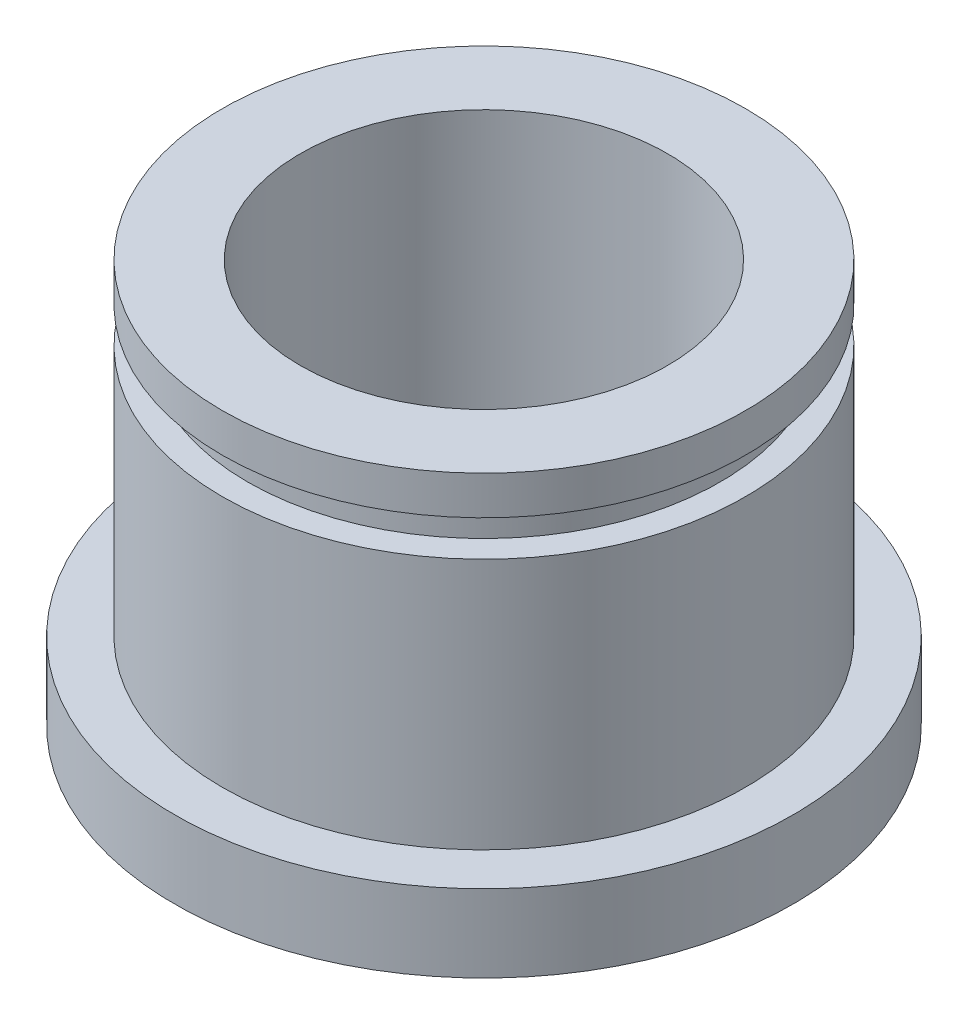
ISO-10303-21;
HEADER;
FILE_DESCRIPTION(('STEP AP214'),'2;1');
FILE_NAME('part.step','',(''),(''),'','','');
FILE_SCHEMA(('AUTOMOTIVE_DESIGN { 1 0 10303 214 1 1 1 1 }'));
ENDSEC;
DATA;
#1=APPLICATION_CONTEXT('core data for automotive mechanical design processes');
#2=APPLICATION_PROTOCOL_DEFINITION('international standard','automotive_design',2000,#1);
#3=PRODUCT_CONTEXT('',#1,'mechanical');
#4=PRODUCT('Part','Part','',(#3));
#5=PRODUCT_RELATED_PRODUCT_CATEGORY('part','',(#4));
#6=PRODUCT_DEFINITION_FORMATION('','',#4);
#7=PRODUCT_DEFINITION_CONTEXT('part definition',#1,'design');
#8=PRODUCT_DEFINITION('design','',#6,#7);
#9=PRODUCT_DEFINITION_SHAPE('','',#8);
#10=(LENGTH_UNIT() NAMED_UNIT(*) SI_UNIT(.MILLI.,.METRE.));
#11=(NAMED_UNIT(*) PLANE_ANGLE_UNIT() SI_UNIT($,.RADIAN.));
#12=(NAMED_UNIT(*) SI_UNIT($,.STERADIAN.) SOLID_ANGLE_UNIT());
#13=UNCERTAINTY_MEASURE_WITH_UNIT(LENGTH_MEASURE(1.E-05),#10,'distance_accuracy_value','');
#14=(GEOMETRIC_REPRESENTATION_CONTEXT(3) GLOBAL_UNCERTAINTY_ASSIGNED_CONTEXT((#13)) GLOBAL_UNIT_ASSIGNED_CONTEXT((#10,
#11,#12)) REPRESENTATION_CONTEXT('',''));
#15=CARTESIAN_POINT('',(0.,0.,0.));
#16=DIRECTION('',(0.,0.,1.));
#17=DIRECTION('',(1.,0.,0.));
#18=AXIS2_PLACEMENT_3D('',#15,#16,#17);
#19=CARTESIAN_POINT('',(0.,-4.143375,0.));
#20=DIRECTION('',(0.,1.,0.));
#21=DIRECTION('',(0.,0.,1.));
#22=AXIS2_PLACEMENT_3D('',#19,#20,#21);
#23=PLANE('',#22);
#24=CARTESIAN_POINT('',(0.,-4.143375,0.));
#25=DIRECTION('',(0.,1.,0.));
#26=DIRECTION('',(0.,0.,1.));
#27=AXIS2_PLACEMENT_3D('',#24,#25,#26);
#28=CIRCLE('',#27,4.56412599999999);
#29=CARTESIAN_POINT('',(0.,-4.143375,4.56412599999999));
#30=VERTEX_POINT('',#29);
#31=EDGE_CURVE('E44',#30,#30,#28,.T.);
#32=ORIENTED_EDGE('',*,*,#31,.T.);
#33=EDGE_LOOP('',(#32));
#34=FACE_BOUND('',#33,.T.);
#35=CARTESIAN_POINT('',(0.,-4.143375,0.));
#36=DIRECTION('',(0.,-1.,0.));
#37=DIRECTION('',(0.,0.,-1.));
#38=AXIS2_PLACEMENT_3D('',#35,#36,#37);
#39=CIRCLE('',#38,6.35);
#40=CARTESIAN_POINT('',(0.,-4.143375,-6.35));
#41=VERTEX_POINT('',#40);
#42=EDGE_CURVE('E50',#41,#41,#39,.T.);
#43=ORIENTED_EDGE('',*,*,#42,.T.);
#44=EDGE_LOOP('',(#43));
#45=FACE_BOUND('',#44,.T.);
#46=ADVANCED_FACE('F36',(#34,#45),#23,.F.);
#47=CARTESIAN_POINT('',(0.,0.,0.));
#48=DIRECTION('',(0.,-1.,0.));
#49=DIRECTION('',(0.,0.,-1.));
#50=AXIS2_PLACEMENT_3D('',#47,#48,#49);
#51=CYLINDRICAL_SURFACE('',#50,6.35);
#52=ORIENTED_EDGE('',*,*,#42,.F.);
#53=EDGE_LOOP('',(#52));
#54=FACE_BOUND('',#53,.T.);
#55=CARTESIAN_POINT('',(0.,-2.555875,0.));
#56=DIRECTION('',(0.,-1.,0.));
#57=DIRECTION('',(0.,0.,-1.));
#58=AXIS2_PLACEMENT_3D('',#55,#56,#57);
#59=CIRCLE('',#58,6.35);
#60=CARTESIAN_POINT('',(0.,-2.555875,-6.35));
#61=VERTEX_POINT('',#60);
#62=EDGE_CURVE('E56',#61,#61,#59,.T.);
#63=ORIENTED_EDGE('',*,*,#62,.T.);
#64=EDGE_LOOP('',(#63));
#65=FACE_BOUND('',#64,.T.);
#66=ADVANCED_FACE('F113',(#54,#65),#51,.T.);
#67=CARTESIAN_POINT('',(0.,-2.555875,6.35));
#68=DIRECTION('',(0.,-1.,0.));
#69=DIRECTION('',(0.,0.,-1.));
#70=AXIS2_PLACEMENT_3D('',#67,#68,#69);
#71=PLANE('',#70);
#72=ORIENTED_EDGE('',*,*,#62,.F.);
#73=EDGE_LOOP('',(#72));
#74=FACE_BOUND('',#73,.T.);
#75=CARTESIAN_POINT('',(0.,-2.555875,0.));
#76=DIRECTION('',(0.,-1.,0.));
#77=DIRECTION('',(0.,0.,-1.));
#78=AXIS2_PLACEMENT_3D('',#75,#76,#77);
#79=CIRCLE('',#78,5.3721);
#80=CARTESIAN_POINT('',(0.,-2.555875,-5.3721));
#81=VERTEX_POINT('',#80);
#82=EDGE_CURVE('E62',#81,#81,#79,.T.);
#83=ORIENTED_EDGE('',*,*,#82,.T.);
#84=EDGE_LOOP('',(#83));
#85=FACE_BOUND('',#84,.T.);
#86=ADVANCED_FACE('F117',(#74,#85),#71,.F.);
#87=CARTESIAN_POINT('',(0.,0.,0.));
#88=DIRECTION('',(0.,-1.,0.));
#89=DIRECTION('',(0.,0.,-1.));
#90=AXIS2_PLACEMENT_3D('',#87,#88,#89);
#91=CYLINDRICAL_SURFACE('',#90,5.3721);
#92=ORIENTED_EDGE('',*,*,#82,.F.);
#93=EDGE_LOOP('',(#92));
#94=FACE_BOUND('',#93,.T.);
#95=CARTESIAN_POINT('',(0.,2.613025,0.));
#96=DIRECTION('',(0.,-1.,0.));
#97=DIRECTION('',(0.,0.,-1.));
#98=AXIS2_PLACEMENT_3D('',#95,#96,#97);
#99=CIRCLE('',#98,5.3721);
#100=CARTESIAN_POINT('',(0.,2.613025,-5.3721));
#101=VERTEX_POINT('',#100);
#102=EDGE_CURVE('E66',#101,#101,#99,.T.);
#103=ORIENTED_EDGE('',*,*,#102,.T.);
#104=EDGE_LOOP('',(#103));
#105=FACE_BOUND('',#104,.T.);
#106=ADVANCED_FACE('F124',(#94,#105),#91,.T.);
#107=CARTESIAN_POINT('',(0.,2.613025,5.3721));
#108=DIRECTION('',(0.,-1.,0.));
#109=DIRECTION('',(0.,0.,-1.));
#110=AXIS2_PLACEMENT_3D('',#107,#108,#109);
#111=PLANE('',#110);
#112=ORIENTED_EDGE('',*,*,#102,.F.);
#113=EDGE_LOOP('',(#112));
#114=FACE_BOUND('',#113,.T.);
#115=CARTESIAN_POINT('',(0.,2.613025,0.));
#116=DIRECTION('',(0.,-1.,0.));
#117=DIRECTION('',(0.,0.,-1.));
#118=AXIS2_PLACEMENT_3D('',#115,#116,#117);
#119=CIRCLE('',#118,4.8514);
#120=CARTESIAN_POINT('',(0.,2.613025,-4.8514));
#121=VERTEX_POINT('',#120);
#122=EDGE_CURVE('E70',#121,#121,#119,.T.);
#123=ORIENTED_EDGE('',*,*,#122,.T.);
#124=EDGE_LOOP('',(#123));
#125=FACE_BOUND('',#124,.T.);
#126=ADVANCED_FACE('F128',(#114,#125),#111,.F.);
#127=CARTESIAN_POINT('',(0.,0.,0.));
#128=DIRECTION('',(0.,-1.,0.));
#129=DIRECTION('',(0.,0.,-1.));
#130=AXIS2_PLACEMENT_3D('',#127,#128,#129);
#131=CYLINDRICAL_SURFACE('',#130,4.8514);
#132=ORIENTED_EDGE('',*,*,#122,.F.);
#133=EDGE_LOOP('',(#132));
#134=FACE_BOUND('',#133,.T.);
#135=CARTESIAN_POINT('',(0.,3.349625,0.));
#136=DIRECTION('',(0.,-1.,0.));
#137=DIRECTION('',(0.,0.,-1.));
#138=AXIS2_PLACEMENT_3D('',#135,#136,#137);
#139=CIRCLE('',#138,4.8514);
#140=CARTESIAN_POINT('',(0.,3.349625,-4.8514));
#141=VERTEX_POINT('',#140);
#142=EDGE_CURVE('E74',#141,#141,#139,.T.);
#143=ORIENTED_EDGE('',*,*,#142,.T.);
#144=EDGE_LOOP('',(#143));
#145=FACE_BOUND('',#144,.T.);
#146=ADVANCED_FACE('F108',(#134,#145),#131,.T.);
#147=CARTESIAN_POINT('',(0.,3.349625,4.8514));
#148=DIRECTION('',(0.,1.,0.));
#149=DIRECTION('',(0.,0.,1.));
#150=AXIS2_PLACEMENT_3D('',#147,#148,#149);
#151=PLANE('',#150);
#152=ORIENTED_EDGE('',*,*,#142,.F.);
#153=EDGE_LOOP('',(#152));
#154=FACE_BOUND('',#153,.T.);
#155=CARTESIAN_POINT('',(0.,3.349625,0.));
#156=DIRECTION('',(0.,-1.,0.));
#157=DIRECTION('',(0.,0.,-1.));
#158=AXIS2_PLACEMENT_3D('',#155,#156,#157);
#159=CIRCLE('',#158,5.3721);
#160=CARTESIAN_POINT('',(0.,3.349625,-5.3721));
#161=VERTEX_POINT('',#160);
#162=EDGE_CURVE('E78',#161,#161,#159,.T.);
#163=ORIENTED_EDGE('',*,*,#162,.T.);
#164=EDGE_LOOP('',(#163));
#165=FACE_BOUND('',#164,.T.);
#166=ADVANCED_FACE('F102',(#154,#165),#151,.F.);
#167=CARTESIAN_POINT('',(0.,0.,0.));
#168=DIRECTION('',(0.,-1.,0.));
#169=DIRECTION('',(0.,0.,-1.));
#170=AXIS2_PLACEMENT_3D('',#167,#168,#169);
#171=CYLINDRICAL_SURFACE('',#170,5.3721);
#172=ORIENTED_EDGE('',*,*,#162,.F.);
#173=EDGE_LOOP('',(#172));
#174=FACE_BOUND('',#173,.T.);
#175=CARTESIAN_POINT('',(0.,4.143375,0.));
#176=DIRECTION('',(0.,-1.,0.));
#177=DIRECTION('',(0.,0.,-1.));
#178=AXIS2_PLACEMENT_3D('',#175,#176,#177);
#179=CIRCLE('',#178,5.3721);
#180=CARTESIAN_POINT('',(0.,4.143375,-5.3721));
#181=VERTEX_POINT('',#180);
#182=EDGE_CURVE('E82',#181,#181,#179,.T.);
#183=ORIENTED_EDGE('',*,*,#182,.T.);
#184=EDGE_LOOP('',(#183));
#185=FACE_BOUND('',#184,.T.);
#186=ADVANCED_FACE('F97',(#174,#185),#171,.T.);
#187=CARTESIAN_POINT('',(0.,4.143375,5.3721));
#188=DIRECTION('',(0.,-1.,0.));
#189=DIRECTION('',(0.,0.,-1.));
#190=AXIS2_PLACEMENT_3D('',#187,#188,#189);
#191=PLANE('',#190);
#192=CARTESIAN_POINT('',(0.,4.143375,0.));
#193=DIRECTION('',(0.,1.,0.));
#194=DIRECTION('',(0.,0.,1.));
#195=AXIS2_PLACEMENT_3D('',#192,#193,#194);
#196=CIRCLE('',#195,3.77037599999999);
#197=CARTESIAN_POINT('',(0.,4.143375,3.77037599999999));
#198=VERTEX_POINT('',#197);
#199=EDGE_CURVE('E86',#198,#198,#196,.T.);
#200=ORIENTED_EDGE('',*,*,#199,.F.);
#201=EDGE_LOOP('',(#200));
#202=FACE_BOUND('',#201,.T.);
#203=ORIENTED_EDGE('',*,*,#182,.F.);
#204=EDGE_LOOP('',(#203));
#205=FACE_BOUND('',#204,.T.);
#206=ADVANCED_FACE('F94',(#202,#205),#191,.F.);
#207=CARTESIAN_POINT('',(0.,4.143375,0.));
#208=DIRECTION('',(0.,1.,0.));
#209=DIRECTION('',(0.,0.,1.));
#210=AXIS2_PLACEMENT_3D('',#207,#208,#209);
#211=CYLINDRICAL_SURFACE('',#210,3.77037599999999);
#212=CARTESIAN_POINT('',(0.,-3.349625,0.));
#213=DIRECTION('',(0.,1.,0.));
#214=DIRECTION('',(0.,0.,1.));
#215=AXIS2_PLACEMENT_3D('',#212,#213,#214);
#216=CIRCLE('',#215,3.77037599999999);
#217=CARTESIAN_POINT('',(0.,-3.349625,3.77037599999999));
#218=VERTEX_POINT('',#217);
#219=EDGE_CURVE('E10',#218,#218,#216,.F.);
#220=ORIENTED_EDGE('',*,*,#219,.T.);
#221=EDGE_LOOP('',(#220));
#222=FACE_BOUND('',#221,.T.);
#223=ORIENTED_EDGE('',*,*,#199,.T.);
#224=EDGE_LOOP('',(#223));
#225=FACE_BOUND('',#224,.T.);
#226=ADVANCED_FACE('F92',(#222,#225),#211,.F.);
#227=CARTESIAN_POINT('',(0.,-4.143375,0.));
#228=DIRECTION('',(0.,-1.,0.));
#229=DIRECTION('',(0.,0.,-1.));
#230=AXIS2_PLACEMENT_3D('',#227,#228,#229);
#231=CONICAL_SURFACE('',#230,4.56412599999999,0.785398163397446);
#232=ORIENTED_EDGE('',*,*,#219,.F.);
#233=EDGE_LOOP('',(#232));
#234=FACE_BOUND('',#233,.T.);
#235=ORIENTED_EDGE('',*,*,#31,.F.);
#236=EDGE_LOOP('',(#235));
#237=FACE_BOUND('',#236,.T.);
#238=ADVANCED_FACE('F38',(#234,#237),#231,.F.);
#239=CLOSED_SHELL('',(#46,#66,#86,#106,#126,#146,#166,#186,#206,#226,#238));
#240=MANIFOLD_SOLID_BREP('B2',#239);
#241=ADVANCED_BREP_SHAPE_REPRESENTATION('',(#18,#240),#14);
#242=SHAPE_DEFINITION_REPRESENTATION(#9,#241);
ENDSEC;
END-ISO-10303-21;
